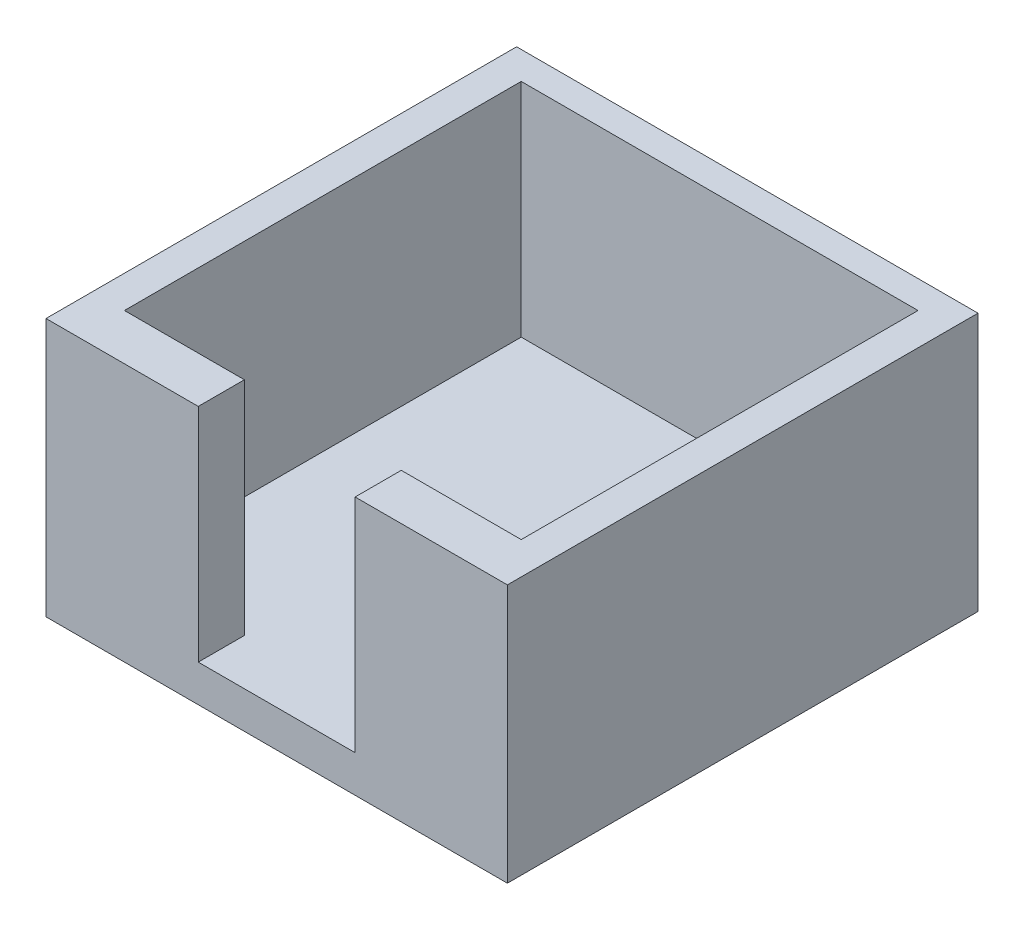
ISO-10303-21;
HEADER;
FILE_DESCRIPTION(('STEP AP214'),'2;1');
FILE_NAME('part.step','',(''),(''),'','','');
FILE_SCHEMA(('AUTOMOTIVE_DESIGN { 1 0 10303 214 1 1 1 1 }'));
ENDSEC;
DATA;
#1=APPLICATION_CONTEXT('core data for automotive mechanical design processes');
#2=APPLICATION_PROTOCOL_DEFINITION('international standard','automotive_design',2000,#1);
#3=PRODUCT_CONTEXT('',#1,'mechanical');
#4=PRODUCT('Part','Part','',(#3));
#5=PRODUCT_RELATED_PRODUCT_CATEGORY('part','',(#4));
#6=PRODUCT_DEFINITION_FORMATION('','',#4);
#7=PRODUCT_DEFINITION_CONTEXT('part definition',#1,'design');
#8=PRODUCT_DEFINITION('design','',#6,#7);
#9=PRODUCT_DEFINITION_SHAPE('','',#8);
#10=(LENGTH_UNIT() NAMED_UNIT(*) SI_UNIT(.MILLI.,.METRE.));
#11=(NAMED_UNIT(*) PLANE_ANGLE_UNIT() SI_UNIT($,.RADIAN.));
#12=(NAMED_UNIT(*) SI_UNIT($,.STERADIAN.) SOLID_ANGLE_UNIT());
#13=UNCERTAINTY_MEASURE_WITH_UNIT(LENGTH_MEASURE(1.E-05),#10,'distance_accuracy_value','');
#14=(GEOMETRIC_REPRESENTATION_CONTEXT(3) GLOBAL_UNCERTAINTY_ASSIGNED_CONTEXT((#13)) GLOBAL_UNIT_ASSIGNED_CONTEXT((#10,
#11,#12)) REPRESENTATION_CONTEXT('',''));
#15=CARTESIAN_POINT('',(0.,0.,0.));
#16=DIRECTION('',(0.,0.,1.));
#17=DIRECTION('',(1.,0.,0.));
#18=AXIS2_PLACEMENT_3D('',#15,#16,#17);
#19=CARTESIAN_POINT('',(0.,28.,0.));
#20=DIRECTION('',(1.,0.,0.));
#21=DIRECTION('',(0.,0.,-1.));
#22=AXIS2_PLACEMENT_3D('',#19,#20,#21);
#23=PLANE('',#22);
#24=DIRECTION('',(0.,0.,1.));
#25=VECTOR('',#24,1.);
#26=CARTESIAN_POINT('',(0.,0.,0.));
#27=LINE('',#26,#25);
#28=CARTESIAN_POINT('',(0.,0.,-51.));
#29=VERTEX_POINT('',#28);
#30=CARTESIAN_POINT('',(0.,0.,0.));
#31=VERTEX_POINT('',#30);
#32=EDGE_CURVE('E186',#29,#31,#27,.T.);
#33=ORIENTED_EDGE('',*,*,#32,.T.);
#34=DIRECTION('',(0.,-1.,0.));
#35=VECTOR('',#34,1.);
#36=CARTESIAN_POINT('',(0.,28.,0.));
#37=LINE('',#36,#35);
#38=CARTESIAN_POINT('',(0.,28.,0.));
#39=VERTEX_POINT('',#38);
#40=EDGE_CURVE('E11',#39,#31,#37,.T.);
#41=ORIENTED_EDGE('',*,*,#40,.F.);
#42=DIRECTION('',(0.,0.,1.));
#43=VECTOR('',#42,1.);
#44=CARTESIAN_POINT('',(0.,28.,0.));
#45=LINE('',#44,#43);
#46=CARTESIAN_POINT('',(0.,28.,-51.));
#47=VERTEX_POINT('',#46);
#48=EDGE_CURVE('E198',#47,#39,#45,.T.);
#49=ORIENTED_EDGE('',*,*,#48,.F.);
#50=DIRECTION('',(0.,-1.,0.));
#51=VECTOR('',#50,1.);
#52=CARTESIAN_POINT('',(0.,28.,-51.));
#53=LINE('',#52,#51);
#54=EDGE_CURVE('E205',#47,#29,#53,.T.);
#55=ORIENTED_EDGE('',*,*,#54,.T.);
#56=EDGE_LOOP('',(#33,#41,#49,#55));
#57=FACE_BOUND('',#56,.T.);
#58=ADVANCED_FACE('F33',(#57),#23,.F.);
#59=CARTESIAN_POINT('',(0.,28.,0.));
#60=DIRECTION('',(0.,0.,-1.));
#61=DIRECTION('',(-1.,0.,0.));
#62=AXIS2_PLACEMENT_3D('',#59,#60,#61);
#63=PLANE('',#62);
#64=DIRECTION('',(1.,0.,0.));
#65=VECTOR('',#64,1.);
#66=CARTESIAN_POINT('',(0.,28.,0.));
#67=LINE('',#66,#65);
#68=CARTESIAN_POINT('',(33.5,28.,0.));
#69=VERTEX_POINT('',#68);
#70=CARTESIAN_POINT('',(50.,28.,0.));
#71=VERTEX_POINT('',#70);
#72=EDGE_CURVE('E200',#69,#71,#67,.T.);
#73=ORIENTED_EDGE('',*,*,#72,.F.);
#74=DIRECTION('',(0.,1.,0.));
#75=VECTOR('',#74,1.);
#76=CARTESIAN_POINT('',(33.5,4.,0.));
#77=LINE('',#76,#75);
#78=CARTESIAN_POINT('',(33.5,4.,0.));
#79=VERTEX_POINT('',#78);
#80=EDGE_CURVE('E195',#79,#69,#77,.T.);
#81=ORIENTED_EDGE('',*,*,#80,.F.);
#82=DIRECTION('',(1.,0.,0.));
#83=VECTOR('',#82,1.);
#84=CARTESIAN_POINT('',(16.5,4.,0.));
#85=LINE('',#84,#83);
#86=CARTESIAN_POINT('',(16.5,4.,0.));
#87=VERTEX_POINT('',#86);
#88=EDGE_CURVE('E146',#87,#79,#85,.T.);
#89=ORIENTED_EDGE('',*,*,#88,.F.);
#90=DIRECTION('',(0.,1.,0.));
#91=VECTOR('',#90,1.);
#92=CARTESIAN_POINT('',(16.5,4.,0.));
#93=LINE('',#92,#91);
#94=CARTESIAN_POINT('',(16.5,28.,0.));
#95=VERTEX_POINT('',#94);
#96=EDGE_CURVE('E137',#87,#95,#93,.T.);
#97=ORIENTED_EDGE('',*,*,#96,.T.);
#98=EDGE_CURVE('E84',#39,#95,#67,.T.);
#99=ORIENTED_EDGE('',*,*,#98,.F.);
#100=ORIENTED_EDGE('',*,*,#40,.T.);
#101=DIRECTION('',(1.,0.,0.));
#102=VECTOR('',#101,1.);
#103=CARTESIAN_POINT('',(0.,0.,0.));
#104=LINE('',#103,#102);
#105=CARTESIAN_POINT('',(50.,0.,0.));
#106=VERTEX_POINT('',#105);
#107=EDGE_CURVE('E208',#31,#106,#104,.T.);
#108=ORIENTED_EDGE('',*,*,#107,.T.);
#109=DIRECTION('',(0.,-1.,0.));
#110=VECTOR('',#109,1.);
#111=CARTESIAN_POINT('',(50.,28.,0.));
#112=LINE('',#111,#110);
#113=EDGE_CURVE('E40',#71,#106,#112,.T.);
#114=ORIENTED_EDGE('',*,*,#113,.F.);
#115=EDGE_LOOP('',(#73,#81,#89,#97,#99,#100,#108,#114));
#116=FACE_BOUND('',#115,.T.);
#117=ADVANCED_FACE('F238',(#116),#63,.F.);
#118=CARTESIAN_POINT('',(50.,28.,0.));
#119=DIRECTION('',(-1.,0.,0.));
#120=DIRECTION('',(0.,0.,1.));
#121=AXIS2_PLACEMENT_3D('',#118,#119,#120);
#122=PLANE('',#121);
#123=DIRECTION('',(0.,0.,-1.));
#124=VECTOR('',#123,1.);
#125=CARTESIAN_POINT('',(50.,0.,0.));
#126=LINE('',#125,#124);
#127=CARTESIAN_POINT('',(50.,0.,-51.));
#128=VERTEX_POINT('',#127);
#129=EDGE_CURVE('E210',#106,#128,#126,.T.);
#130=ORIENTED_EDGE('',*,*,#129,.T.);
#131=DIRECTION('',(0.,-1.,0.));
#132=VECTOR('',#131,1.);
#133=CARTESIAN_POINT('',(50.,28.,-51.));
#134=LINE('',#133,#132);
#135=CARTESIAN_POINT('',(50.,28.,-51.));
#136=VERTEX_POINT('',#135);
#137=EDGE_CURVE('E214',#136,#128,#134,.T.);
#138=ORIENTED_EDGE('',*,*,#137,.F.);
#139=DIRECTION('',(0.,0.,-1.));
#140=VECTOR('',#139,1.);
#141=CARTESIAN_POINT('',(50.,28.,0.));
#142=LINE('',#141,#140);
#143=EDGE_CURVE('E202',#71,#136,#142,.T.);
#144=ORIENTED_EDGE('',*,*,#143,.F.);
#145=ORIENTED_EDGE('',*,*,#113,.T.);
#146=EDGE_LOOP('',(#130,#138,#144,#145));
#147=FACE_BOUND('',#146,.T.);
#148=ADVANCED_FACE('F220',(#147),#122,.F.);
#149=CARTESIAN_POINT('',(0.,28.,-51.));
#150=DIRECTION('',(0.,0.,1.));
#151=DIRECTION('',(1.,0.,0.));
#152=AXIS2_PLACEMENT_3D('',#149,#150,#151);
#153=PLANE('',#152);
#154=DIRECTION('',(-1.,0.,0.));
#155=VECTOR('',#154,1.);
#156=CARTESIAN_POINT('',(0.,0.,-51.));
#157=LINE('',#156,#155);
#158=EDGE_CURVE('E77',#128,#29,#157,.T.);
#159=ORIENTED_EDGE('',*,*,#158,.T.);
#160=ORIENTED_EDGE('',*,*,#54,.F.);
#161=DIRECTION('',(-1.,0.,0.));
#162=VECTOR('',#161,1.);
#163=CARTESIAN_POINT('',(0.,28.,-51.));
#164=LINE('',#163,#162);
#165=EDGE_CURVE('E56',#136,#47,#164,.T.);
#166=ORIENTED_EDGE('',*,*,#165,.F.);
#167=ORIENTED_EDGE('',*,*,#137,.T.);
#168=EDGE_LOOP('',(#159,#160,#166,#167));
#169=FACE_BOUND('',#168,.T.);
#170=ADVANCED_FACE('F229',(#169),#153,.F.);
#171=CARTESIAN_POINT('',(0.,28.,0.));
#172=DIRECTION('',(0.,-1.,0.));
#173=DIRECTION('',(0.,0.,-1.));
#174=AXIS2_PLACEMENT_3D('',#171,#172,#173);
#175=PLANE('',#174);
#176=DIRECTION('',(1.,0.,0.));
#177=VECTOR('',#176,1.);
#178=CARTESIAN_POINT('',(46.5,28.,-5.));
#179=LINE('',#178,#177);
#180=CARTESIAN_POINT('',(33.5,28.,-5.));
#181=VERTEX_POINT('',#180);
#182=CARTESIAN_POINT('',(46.5,28.,-5.));
#183=VERTEX_POINT('',#182);
#184=EDGE_CURVE('E176',#181,#183,#179,.T.);
#185=ORIENTED_EDGE('',*,*,#184,.F.);
#186=DIRECTION('',(0.,0.,-1.));
#187=VECTOR('',#186,1.);
#188=CARTESIAN_POINT('',(33.5,28.,-5.));
#189=LINE('',#188,#187);
#190=EDGE_CURVE('E173',#69,#181,#189,.T.);
#191=ORIENTED_EDGE('',*,*,#190,.F.);
#192=ORIENTED_EDGE('',*,*,#72,.T.);
#193=ORIENTED_EDGE('',*,*,#143,.T.);
#194=ORIENTED_EDGE('',*,*,#165,.T.);
#195=ORIENTED_EDGE('',*,*,#48,.T.);
#196=ORIENTED_EDGE('',*,*,#98,.T.);
#197=DIRECTION('',(0.,0.,1.));
#198=VECTOR('',#197,1.);
#199=CARTESIAN_POINT('',(16.5,28.,-5.));
#200=LINE('',#199,#198);
#201=CARTESIAN_POINT('',(16.5,28.,-5.));
#202=VERTEX_POINT('',#201);
#203=EDGE_CURVE('E171',#202,#95,#200,.T.);
#204=ORIENTED_EDGE('',*,*,#203,.F.);
#205=DIRECTION('',(1.,0.,0.));
#206=VECTOR('',#205,1.);
#207=CARTESIAN_POINT('',(16.5,28.,-5.));
#208=LINE('',#207,#206);
#209=CARTESIAN_POINT('',(3.5,28.,-5.));
#210=VERTEX_POINT('',#209);
#211=EDGE_CURVE('E47',#210,#202,#208,.T.);
#212=ORIENTED_EDGE('',*,*,#211,.F.);
#213=DIRECTION('',(0.,0.,1.));
#214=VECTOR('',#213,1.);
#215=CARTESIAN_POINT('',(3.5,28.,-5.));
#216=LINE('',#215,#214);
#217=CARTESIAN_POINT('',(3.5,28.,-48.));
#218=VERTEX_POINT('',#217);
#219=EDGE_CURVE('E151',#218,#210,#216,.T.);
#220=ORIENTED_EDGE('',*,*,#219,.F.);
#221=DIRECTION('',(-1.,0.,0.));
#222=VECTOR('',#221,1.);
#223=CARTESIAN_POINT('',(46.5,28.,-48.));
#224=LINE('',#223,#222);
#225=CARTESIAN_POINT('',(46.5,28.,-48.));
#226=VERTEX_POINT('',#225);
#227=EDGE_CURVE('E154',#226,#218,#224,.T.);
#228=ORIENTED_EDGE('',*,*,#227,.F.);
#229=DIRECTION('',(0.,0.,-1.));
#230=VECTOR('',#229,1.);
#231=CARTESIAN_POINT('',(46.5,28.,-5.));
#232=LINE('',#231,#230);
#233=EDGE_CURVE('E179',#183,#226,#232,.T.);
#234=ORIENTED_EDGE('',*,*,#233,.F.);
#235=EDGE_LOOP('',(#185,#191,#192,#193,#194,#195,#196,#204,#212,#220,#228,#234));
#236=FACE_BOUND('',#235,.T.);
#237=ADVANCED_FACE('F231',(#236),#175,.F.);
#238=CARTESIAN_POINT('',(0.,0.,0.));
#239=DIRECTION('',(0.,-1.,0.));
#240=DIRECTION('',(0.,0.,-1.));
#241=AXIS2_PLACEMENT_3D('',#238,#239,#240);
#242=PLANE('',#241);
#243=ORIENTED_EDGE('',*,*,#32,.F.);
#244=ORIENTED_EDGE('',*,*,#158,.F.);
#245=ORIENTED_EDGE('',*,*,#129,.F.);
#246=ORIENTED_EDGE('',*,*,#107,.F.);
#247=EDGE_LOOP('',(#243,#244,#245,#246));
#248=FACE_BOUND('',#247,.T.);
#249=ADVANCED_FACE('F225',(#248),#242,.T.);
#250=CARTESIAN_POINT('',(16.5,4.,-5.));
#251=DIRECTION('',(0.,0.,1.));
#252=DIRECTION('',(1.,0.,0.));
#253=AXIS2_PLACEMENT_3D('',#250,#251,#252);
#254=PLANE('',#253);
#255=ORIENTED_EDGE('',*,*,#211,.T.);
#256=DIRECTION('',(0.,1.,0.));
#257=VECTOR('',#256,1.);
#258=CARTESIAN_POINT('',(16.5,4.,-5.));
#259=LINE('',#258,#257);
#260=CARTESIAN_POINT('',(16.5,4.,-5.));
#261=VERTEX_POINT('',#260);
#262=EDGE_CURVE('E129',#261,#202,#259,.T.);
#263=ORIENTED_EDGE('',*,*,#262,.F.);
#264=DIRECTION('',(1.,0.,0.));
#265=VECTOR('',#264,1.);
#266=CARTESIAN_POINT('',(16.5,4.,-5.));
#267=LINE('',#266,#265);
#268=CARTESIAN_POINT('',(3.5,4.,-5.));
#269=VERTEX_POINT('',#268);
#270=EDGE_CURVE('E133',#269,#261,#267,.T.);
#271=ORIENTED_EDGE('',*,*,#270,.F.);
#272=DIRECTION('',(0.,1.,0.));
#273=VECTOR('',#272,1.);
#274=CARTESIAN_POINT('',(3.5,4.,-5.));
#275=LINE('',#274,#273);
#276=EDGE_CURVE('E184',#269,#210,#275,.T.);
#277=ORIENTED_EDGE('',*,*,#276,.T.);
#278=EDGE_LOOP('',(#255,#263,#271,#277));
#279=FACE_BOUND('',#278,.T.);
#280=ADVANCED_FACE('F131',(#279),#254,.F.);
#281=CARTESIAN_POINT('',(3.5,4.,-5.));
#282=DIRECTION('',(-1.,0.,0.));
#283=DIRECTION('',(0.,0.,1.));
#284=AXIS2_PLACEMENT_3D('',#281,#282,#283);
#285=PLANE('',#284);
#286=ORIENTED_EDGE('',*,*,#219,.T.);
#287=ORIENTED_EDGE('',*,*,#276,.F.);
#288=DIRECTION('',(0.,0.,1.));
#289=VECTOR('',#288,1.);
#290=CARTESIAN_POINT('',(3.5,4.,-5.));
#291=LINE('',#290,#289);
#292=CARTESIAN_POINT('',(3.5,4.,-48.));
#293=VERTEX_POINT('',#292);
#294=EDGE_CURVE('E138',#293,#269,#291,.T.);
#295=ORIENTED_EDGE('',*,*,#294,.F.);
#296=DIRECTION('',(0.,1.,0.));
#297=VECTOR('',#296,1.);
#298=CARTESIAN_POINT('',(3.5,4.,-48.));
#299=LINE('',#298,#297);
#300=EDGE_CURVE('E187',#293,#218,#299,.T.);
#301=ORIENTED_EDGE('',*,*,#300,.T.);
#302=EDGE_LOOP('',(#286,#287,#295,#301));
#303=FACE_BOUND('',#302,.T.);
#304=ADVANCED_FACE('F257',(#303),#285,.F.);
#305=CARTESIAN_POINT('',(46.5,4.,-48.));
#306=DIRECTION('',(0.,0.,-1.));
#307=DIRECTION('',(-1.,0.,0.));
#308=AXIS2_PLACEMENT_3D('',#305,#306,#307);
#309=PLANE('',#308);
#310=ORIENTED_EDGE('',*,*,#227,.T.);
#311=ORIENTED_EDGE('',*,*,#300,.F.);
#312=DIRECTION('',(-1.,0.,0.));
#313=VECTOR('',#312,1.);
#314=CARTESIAN_POINT('',(46.5,4.,-48.));
#315=LINE('',#314,#313);
#316=CARTESIAN_POINT('',(46.5,4.,-48.));
#317=VERTEX_POINT('',#316);
#318=EDGE_CURVE('E167',#317,#293,#315,.T.);
#319=ORIENTED_EDGE('',*,*,#318,.F.);
#320=DIRECTION('',(0.,1.,0.));
#321=VECTOR('',#320,1.);
#322=CARTESIAN_POINT('',(46.5,4.,-48.));
#323=LINE('',#322,#321);
#324=EDGE_CURVE('E189',#317,#226,#323,.T.);
#325=ORIENTED_EDGE('',*,*,#324,.T.);
#326=EDGE_LOOP('',(#310,#311,#319,#325));
#327=FACE_BOUND('',#326,.T.);
#328=ADVANCED_FACE('F260',(#327),#309,.F.);
#329=CARTESIAN_POINT('',(46.5,4.,-5.));
#330=DIRECTION('',(1.,0.,0.));
#331=DIRECTION('',(0.,0.,-1.));
#332=AXIS2_PLACEMENT_3D('',#329,#330,#331);
#333=PLANE('',#332);
#334=ORIENTED_EDGE('',*,*,#233,.T.);
#335=ORIENTED_EDGE('',*,*,#324,.F.);
#336=DIRECTION('',(0.,0.,-1.));
#337=VECTOR('',#336,1.);
#338=CARTESIAN_POINT('',(46.5,4.,-5.));
#339=LINE('',#338,#337);
#340=CARTESIAN_POINT('',(46.5,4.,-5.));
#341=VERTEX_POINT('',#340);
#342=EDGE_CURVE('E164',#341,#317,#339,.T.);
#343=ORIENTED_EDGE('',*,*,#342,.F.);
#344=DIRECTION('',(0.,1.,0.));
#345=VECTOR('',#344,1.);
#346=CARTESIAN_POINT('',(46.5,4.,-5.));
#347=LINE('',#346,#345);
#348=EDGE_CURVE('E191',#341,#183,#347,.T.);
#349=ORIENTED_EDGE('',*,*,#348,.T.);
#350=EDGE_LOOP('',(#334,#335,#343,#349));
#351=FACE_BOUND('',#350,.T.);
#352=ADVANCED_FACE('F263',(#351),#333,.F.);
#353=CARTESIAN_POINT('',(46.5,4.,-5.));
#354=DIRECTION('',(0.,0.,1.));
#355=DIRECTION('',(1.,0.,0.));
#356=AXIS2_PLACEMENT_3D('',#353,#354,#355);
#357=PLANE('',#356);
#358=ORIENTED_EDGE('',*,*,#184,.T.);
#359=ORIENTED_EDGE('',*,*,#348,.F.);
#360=DIRECTION('',(1.,0.,0.));
#361=VECTOR('',#360,1.);
#362=CARTESIAN_POINT('',(46.5,4.,-5.));
#363=LINE('',#362,#361);
#364=CARTESIAN_POINT('',(33.5,4.,-5.));
#365=VERTEX_POINT('',#364);
#366=EDGE_CURVE('E161',#365,#341,#363,.T.);
#367=ORIENTED_EDGE('',*,*,#366,.F.);
#368=DIRECTION('',(0.,1.,0.));
#369=VECTOR('',#368,1.);
#370=CARTESIAN_POINT('',(33.5,4.,-5.));
#371=LINE('',#370,#369);
#372=EDGE_CURVE('E193',#365,#181,#371,.T.);
#373=ORIENTED_EDGE('',*,*,#372,.T.);
#374=EDGE_LOOP('',(#358,#359,#367,#373));
#375=FACE_BOUND('',#374,.T.);
#376=ADVANCED_FACE('F265',(#375),#357,.F.);
#377=CARTESIAN_POINT('',(33.5,4.,-5.));
#378=DIRECTION('',(1.,0.,0.));
#379=DIRECTION('',(0.,0.,-1.));
#380=AXIS2_PLACEMENT_3D('',#377,#378,#379);
#381=PLANE('',#380);
#382=ORIENTED_EDGE('',*,*,#190,.T.);
#383=ORIENTED_EDGE('',*,*,#372,.F.);
#384=DIRECTION('',(0.,0.,-1.));
#385=VECTOR('',#384,1.);
#386=CARTESIAN_POINT('',(33.5,4.,-5.));
#387=LINE('',#386,#385);
#388=EDGE_CURVE('E158',#79,#365,#387,.T.);
#389=ORIENTED_EDGE('',*,*,#388,.F.);
#390=ORIENTED_EDGE('',*,*,#80,.T.);
#391=EDGE_LOOP('',(#382,#383,#389,#390));
#392=FACE_BOUND('',#391,.T.);
#393=ADVANCED_FACE('F252',(#392),#381,.F.);
#394=CARTESIAN_POINT('',(16.5,4.,-5.));
#395=DIRECTION('',(-1.,0.,0.));
#396=DIRECTION('',(0.,0.,1.));
#397=AXIS2_PLACEMENT_3D('',#394,#395,#396);
#398=PLANE('',#397);
#399=ORIENTED_EDGE('',*,*,#203,.T.);
#400=ORIENTED_EDGE('',*,*,#96,.F.);
#401=DIRECTION('',(0.,0.,1.));
#402=VECTOR('',#401,1.);
#403=CARTESIAN_POINT('',(16.5,4.,-5.));
#404=LINE('',#403,#402);
#405=EDGE_CURVE('E141',#261,#87,#404,.T.);
#406=ORIENTED_EDGE('',*,*,#405,.F.);
#407=ORIENTED_EDGE('',*,*,#262,.T.);
#408=EDGE_LOOP('',(#399,#400,#406,#407));
#409=FACE_BOUND('',#408,.T.);
#410=ADVANCED_FACE('F142',(#409),#398,.F.);
#411=CARTESIAN_POINT('',(0.,4.,0.));
#412=DIRECTION('',(0.,-1.,0.));
#413=DIRECTION('',(0.,0.,-1.));
#414=AXIS2_PLACEMENT_3D('',#411,#412,#413);
#415=PLANE('',#414);
#416=ORIENTED_EDGE('',*,*,#270,.T.);
#417=ORIENTED_EDGE('',*,*,#405,.T.);
#418=ORIENTED_EDGE('',*,*,#88,.T.);
#419=ORIENTED_EDGE('',*,*,#388,.T.);
#420=ORIENTED_EDGE('',*,*,#366,.T.);
#421=ORIENTED_EDGE('',*,*,#342,.T.);
#422=ORIENTED_EDGE('',*,*,#318,.T.);
#423=ORIENTED_EDGE('',*,*,#294,.T.);
#424=EDGE_LOOP('',(#416,#417,#418,#419,#420,#421,#422,#423));
#425=FACE_BOUND('',#424,.T.);
#426=ADVANCED_FACE('F148',(#425),#415,.F.);
#427=CLOSED_SHELL('',(#58,#117,#148,#170,#237,#249,#280,#304,#328,#352,#376,#393,#410,#426));
#428=MANIFOLD_SOLID_BREP('B2',#427);
#429=ADVANCED_BREP_SHAPE_REPRESENTATION('',(#18,#428),#14);
#430=SHAPE_DEFINITION_REPRESENTATION(#9,#429);
ENDSEC;
END-ISO-10303-21;
